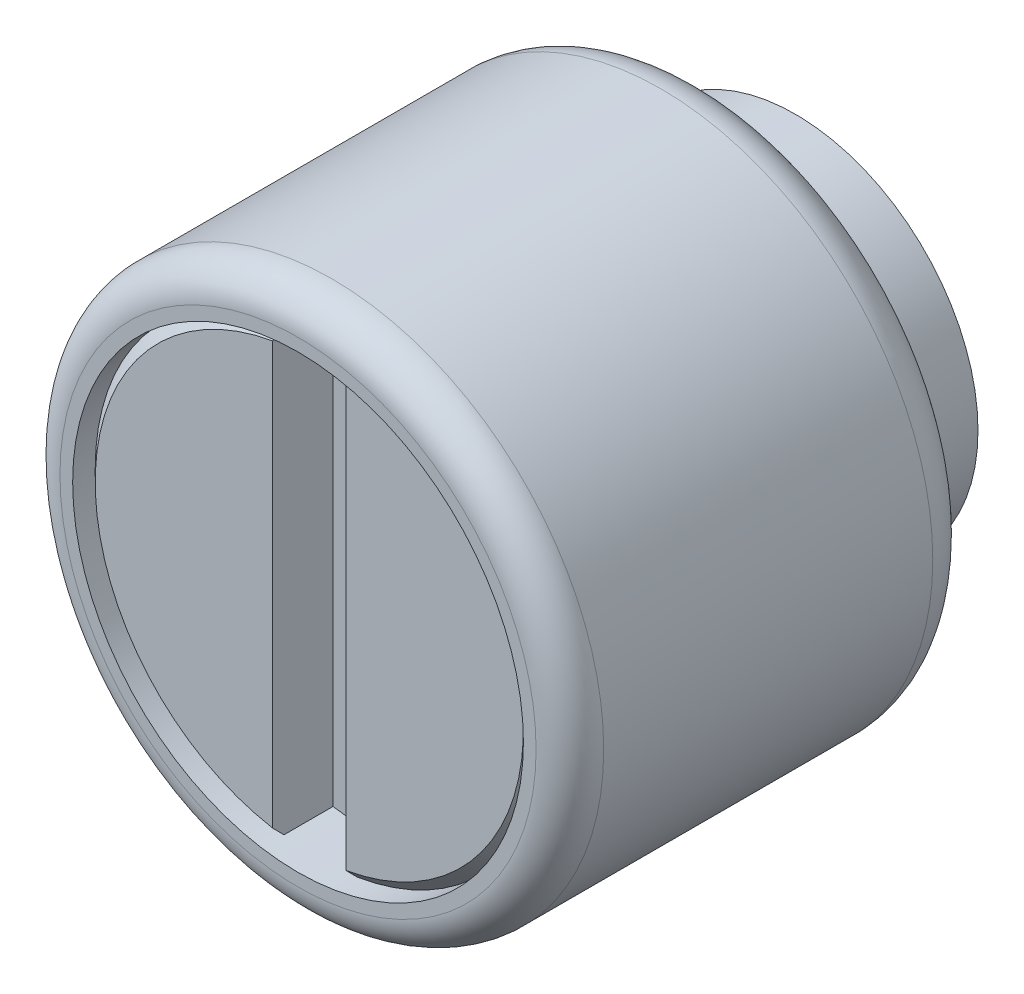
ISO-10303-21;
HEADER;
FILE_DESCRIPTION(('STEP AP214'),'2;1');
FILE_NAME('part.step','',(''),(''),'','','');
FILE_SCHEMA(('AUTOMOTIVE_DESIGN { 1 0 10303 214 1 1 1 1 }'));
ENDSEC;
DATA;
#1=APPLICATION_CONTEXT('core data for automotive mechanical design processes');
#2=APPLICATION_PROTOCOL_DEFINITION('international standard','automotive_design',2000,#1);
#3=PRODUCT_CONTEXT('',#1,'mechanical');
#4=PRODUCT('Part','Part','',(#3));
#5=PRODUCT_RELATED_PRODUCT_CATEGORY('part','',(#4));
#6=PRODUCT_DEFINITION_FORMATION('','',#4);
#7=PRODUCT_DEFINITION_CONTEXT('part definition',#1,'design');
#8=PRODUCT_DEFINITION('design','',#6,#7);
#9=PRODUCT_DEFINITION_SHAPE('','',#8);
#10=(LENGTH_UNIT() NAMED_UNIT(*) SI_UNIT(.MILLI.,.METRE.));
#11=(NAMED_UNIT(*) PLANE_ANGLE_UNIT() SI_UNIT($,.RADIAN.));
#12=(NAMED_UNIT(*) SI_UNIT($,.STERADIAN.) SOLID_ANGLE_UNIT());
#13=UNCERTAINTY_MEASURE_WITH_UNIT(LENGTH_MEASURE(1.E-05),#10,'distance_accuracy_value','');
#14=(GEOMETRIC_REPRESENTATION_CONTEXT(3) GLOBAL_UNCERTAINTY_ASSIGNED_CONTEXT((#13)) GLOBAL_UNIT_ASSIGNED_CONTEXT((#10,
#11,#12)) REPRESENTATION_CONTEXT('',''));
#15=CARTESIAN_POINT('',(0.,0.,0.));
#16=DIRECTION('',(0.,0.,1.));
#17=DIRECTION('',(1.,0.,0.));
#18=AXIS2_PLACEMENT_3D('',#15,#16,#17);
#19=CARTESIAN_POINT('',(0.,0.,5.97));
#20=DIRECTION('',(0.,0.,1.));
#21=DIRECTION('',(1.,0.,0.));
#22=AXIS2_PLACEMENT_3D('',#19,#20,#21);
#23=PLANE('',#22);
#24=DIRECTION('',(0.,1.,0.));
#25=VECTOR('',#24,1.);
#26=CARTESIAN_POINT('',(-0.650000000000001,-3.94683417437317,5.97));
#27=LINE('',#26,#25);
#28=CARTESIAN_POINT('',(-0.650000000000001,3.94683417437317,5.97));
#29=VERTEX_POINT('',#28);
#30=CARTESIAN_POINT('',(-0.650000000000001,-3.94683417437317,5.97));
#31=VERTEX_POINT('',#30);
#32=EDGE_CURVE('E299',#29,#31,#27,.F.);
#33=ORIENTED_EDGE('',*,*,#32,.T.);
#34=CARTESIAN_POINT('',(0.,0.,5.97));
#35=DIRECTION('',(0.,0.,1.));
#36=DIRECTION('',(1.,0.,0.));
#37=AXIS2_PLACEMENT_3D('',#34,#35,#36);
#38=CIRCLE('',#37,4.);
#39=CARTESIAN_POINT('',(0.649999999999999,-3.94683417437317,5.97));
#40=VERTEX_POINT('',#39);
#41=EDGE_CURVE('E92',#31,#40,#38,.T.);
#42=ORIENTED_EDGE('',*,*,#41,.T.);
#43=DIRECTION('',(0.,1.,0.));
#44=VECTOR('',#43,1.);
#45=CARTESIAN_POINT('',(0.649999999999999,3.94683417437317,5.97));
#46=LINE('',#45,#44);
#47=CARTESIAN_POINT('',(0.649999999999999,3.94683417437317,5.97));
#48=VERTEX_POINT('',#47);
#49=EDGE_CURVE('E95',#40,#48,#46,.T.);
#50=ORIENTED_EDGE('',*,*,#49,.T.);
#51=CARTESIAN_POINT('',(0.,0.,5.97));
#52=DIRECTION('',(0.,0.,1.));
#53=DIRECTION('',(1.,0.,0.));
#54=AXIS2_PLACEMENT_3D('',#51,#52,#53);
#55=CIRCLE('',#54,4.);
#56=EDGE_CURVE('E19',#48,#29,#55,.T.);
#57=ORIENTED_EDGE('',*,*,#56,.T.);
#58=EDGE_LOOP('',(#33,#42,#50,#57));
#59=FACE_BOUND('',#58,.T.);
#60=ADVANCED_FACE('F16',(#59),#23,.T.);
#61=CARTESIAN_POINT('',(0.649999999999998,3.94683417437317,7.23999999999999));
#62=DIRECTION('',(1.,0.,0.));
#63=DIRECTION('',(0.,0.,-1.));
#64=AXIS2_PLACEMENT_3D('',#61,#62,#63);
#65=PLANE('',#64);
#66=DIRECTION('',(0.,0.,-1.));
#67=VECTOR('',#66,1.);
#68=CARTESIAN_POINT('',(0.649999999999998,3.94683417437317,7.23999999999999));
#69=LINE('',#68,#67);
#70=CARTESIAN_POINT('',(0.649999999999998,3.94683417437317,6.83999999995824));
#71=VERTEX_POINT('',#70);
#72=EDGE_CURVE('E84',#48,#71,#69,.F.);
#73=ORIENTED_EDGE('',*,*,#72,.F.);
#74=ORIENTED_EDGE('',*,*,#49,.F.);
#75=DIRECTION('',(0.,0.,-1.));
#76=VECTOR('',#75,1.);
#77=CARTESIAN_POINT('',(0.649999999999998,-3.94683417437317,7.23999999999999));
#78=LINE('',#77,#76);
#79=CARTESIAN_POINT('',(0.649999999999998,-3.94683417435229,6.83999999997884));
#80=VERTEX_POINT('',#79);
#81=EDGE_CURVE('E98',#80,#40,#78,.T.);
#82=ORIENTED_EDGE('',*,*,#81,.F.);
#83=CARTESIAN_POINT('',(0.649999999999998,-3.74399519222822,7.03999999993489));
#84=CARTESIAN_POINT('',(0.649999999999998,-3.77781390657289,7.00667905729847));
#85=CARTESIAN_POINT('',(0.649999999999998,-3.81162651226838,6.97335191930114));
#86=CARTESIAN_POINT('',(0.649999999999998,-3.87923950630276,6.90668525264205));
#87=CARTESIAN_POINT('',(0.649999999999998,-3.91303989464167,6.87334572398031));
#88=CARTESIAN_POINT('',(0.649999999999998,-3.94683417433142,6.83999999995768));
#89=B_SPLINE_CURVE_WITH_KNOTS('',3,(#83,#84,#85,#86,#87,#88),.UNSPECIFIED.,.F.,.F.,(4,2,4),(0.,
0.142428627315955,0.28485725438661),.UNSPECIFIED.);
#90=CARTESIAN_POINT('',(0.649999999999998,-3.74399519221504,7.03999999994787));
#91=VERTEX_POINT('',#90);
#92=EDGE_CURVE('E111',#91,#80,#89,.T.);
#93=ORIENTED_EDGE('',*,*,#92,.F.);
#94=DIRECTION('',(0.,1.,0.));
#95=VECTOR('',#94,1.);
#96=CARTESIAN_POINT('',(0.649999999999998,0.,7.03999999999998));
#97=LINE('',#96,#95);
#98=CARTESIAN_POINT('',(0.649999999999998,3.74399519221504,7.03999999994787));
#99=VERTEX_POINT('',#98);
#100=EDGE_CURVE('E138',#99,#91,#97,.F.);
#101=ORIENTED_EDGE('',*,*,#100,.F.);
#102=CARTESIAN_POINT('',(0.649999999999998,3.94683417433285,6.83999999995627));
#103=CARTESIAN_POINT('',(0.649999999999998,3.91303989464286,6.87334572397914));
#104=CARTESIAN_POINT('',(0.649999999999998,3.87923950630372,6.90668525264111));
#105=CARTESIAN_POINT('',(0.649999999999998,3.81162651226886,6.97335191930067));
#106=CARTESIAN_POINT('',(0.649999999999998,3.77781390657313,7.00667905729824));
#107=CARTESIAN_POINT('',(0.649999999999998,3.74399519222822,7.03999999993489));
#108=B_SPLINE_CURVE_WITH_KNOTS('',3,(#102,#103,#104,#105,#106,#107),.UNSPECIFIED.,.F.,.F.,(4,2,
4),(0.,0.142428627071659,0.284857254388618),.UNSPECIFIED.);
#109=EDGE_CURVE('E103',#71,#99,#108,.T.);
#110=ORIENTED_EDGE('',*,*,#109,.F.);
#111=EDGE_LOOP('',(#73,#74,#82,#93,#101,#110));
#112=FACE_BOUND('',#111,.T.);
#113=ADVANCED_FACE('F101',(#112),#65,.F.);
#114=CARTESIAN_POINT('',(-0.650000000000001,-3.94683417437317,7.23999999999999));
#115=DIRECTION('',(-1.,0.,0.));
#116=DIRECTION('',(0.,0.,1.));
#117=AXIS2_PLACEMENT_3D('',#114,#115,#116);
#118=PLANE('',#117);
#119=DIRECTION('',(0.,1.,0.));
#120=VECTOR('',#119,1.);
#121=CARTESIAN_POINT('',(-0.650000000000001,0.,7.03999999999998));
#122=LINE('',#121,#120);
#123=CARTESIAN_POINT('',(-0.650000000000001,-3.74399519230684,7.03999999997112));
#124=VERTEX_POINT('',#123);
#125=CARTESIAN_POINT('',(-0.650000000000001,3.74399519230684,7.03999999997112));
#126=VERTEX_POINT('',#125);
#127=EDGE_CURVE('E129',#124,#126,#122,.T.);
#128=ORIENTED_EDGE('',*,*,#127,.F.);
#129=CARTESIAN_POINT('',(-0.650000000000001,-3.94683417435983,6.83999999998649));
#130=CARTESIAN_POINT('',(-0.650000000000001,-3.91303989467671,6.87334572401206));
#131=CARTESIAN_POINT('',(-0.650000000000001,-3.87923950634443,6.90668525267674));
#132=CARTESIAN_POINT('',(-0.650000000000001,-3.81162651232332,6.97335191934173));
#133=CARTESIAN_POINT('',(-0.650000000000001,-3.77781390663446,7.00667905734201));
#134=CARTESIAN_POINT('',(-0.650000000000001,-3.74399519229642,7.03999999998138));
#135=B_SPLINE_CURVE_WITH_KNOTS('',3,(#129,#130,#131,#132,#133,#134),.UNSPECIFIED.,.F.,.F.,(4,2,
4),(0.,0.142428627062691,0.284857254370685),.UNSPECIFIED.);
#136=CARTESIAN_POINT('',(-0.650000000000001,-3.94683417437317,6.83999999998666));
#137=VERTEX_POINT('',#136);
#138=EDGE_CURVE('E139',#137,#124,#135,.T.);
#139=ORIENTED_EDGE('',*,*,#138,.F.);
#140=DIRECTION('',(0.,0.,1.));
#141=VECTOR('',#140,1.);
#142=CARTESIAN_POINT('',(-0.650000000000001,-3.94683417437317,7.23999999999999));
#143=LINE('',#142,#141);
#144=EDGE_CURVE('E300',#31,#137,#143,.T.);
#145=ORIENTED_EDGE('',*,*,#144,.F.);
#146=ORIENTED_EDGE('',*,*,#32,.F.);
#147=DIRECTION('',(0.,0.,1.));
#148=VECTOR('',#147,1.);
#149=CARTESIAN_POINT('',(-0.650000000000001,3.94683417437317,7.23999999999999));
#150=LINE('',#149,#148);
#151=CARTESIAN_POINT('',(-0.650000000000001,3.9468341743665,6.83999999999324));
#152=VERTEX_POINT('',#151);
#153=EDGE_CURVE('E88',#152,#29,#150,.F.);
#154=ORIENTED_EDGE('',*,*,#153,.F.);
#155=CARTESIAN_POINT('',(-0.650000000000001,3.74399519229642,7.03999999998138));
#156=CARTESIAN_POINT('',(-0.650000000000001,3.77781390663447,7.00667905734201));
#157=CARTESIAN_POINT('',(-0.650000000000001,3.81162651232332,6.97335191934172));
#158=CARTESIAN_POINT('',(-0.650000000000001,3.87923950634444,6.90668525267674));
#159=CARTESIAN_POINT('',(-0.650000000000001,3.91303989467672,6.87334572401205));
#160=CARTESIAN_POINT('',(-0.650000000000001,3.94683417435983,6.83999999998648));
#161=B_SPLINE_CURVE_WITH_KNOTS('',3,(#155,#156,#157,#158,#159,#160),.UNSPECIFIED.,.F.,.F.,(4,2,
4),(0.,0.142428627307999,0.284857254370697),.UNSPECIFIED.);
#162=EDGE_CURVE('E130',#126,#152,#161,.T.);
#163=ORIENTED_EDGE('',*,*,#162,.F.);
#164=EDGE_LOOP('',(#128,#139,#145,#146,#154,#163));
#165=FACE_BOUND('',#164,.T.);
#166=ADVANCED_FACE('F144',(#165),#118,.F.);
#167=CARTESIAN_POINT('',(0.,0.,7.03999999999998));
#168=DIRECTION('',(0.,0.,1.));
#169=DIRECTION('',(1.,0.,0.));
#170=AXIS2_PLACEMENT_3D('',#167,#168,#169);
#171=PLANE('',#170);
#172=ORIENTED_EDGE('',*,*,#100,.T.);
#173=CARTESIAN_POINT('',(0.,0.,7.03999999996085));
#174=DIRECTION('',(0.,0.,-1.));
#175=DIRECTION('',(-1.,0.,0.));
#176=AXIS2_PLACEMENT_3D('',#173,#174,#175);
#177=CIRCLE('',#176,3.79999999989877);
#178=EDGE_CURVE('E126',#99,#91,#177,.T.);
#179=ORIENTED_EDGE('',*,*,#178,.F.);
#180=EDGE_LOOP('',(#172,#179));
#181=FACE_BOUND('',#180,.T.);
#182=ADVANCED_FACE('F180',(#181),#171,.T.);
#183=CARTESIAN_POINT('',(0.,0.,7.03999999999998));
#184=DIRECTION('',(0.,0.,1.));
#185=DIRECTION('',(1.,0.,0.));
#186=AXIS2_PLACEMENT_3D('',#183,#184,#185);
#187=PLANE('',#186);
#188=ORIENTED_EDGE('',*,*,#127,.T.);
#189=CARTESIAN_POINT('',(0.,0.,7.03999999996086));
#190=DIRECTION('',(0.,0.,-1.));
#191=DIRECTION('',(-1.,0.,0.));
#192=AXIS2_PLACEMENT_3D('',#189,#190,#191);
#193=CIRCLE('',#192,3.80000000001246);
#194=EDGE_CURVE('E123',#124,#126,#193,.T.);
#195=ORIENTED_EDGE('',*,*,#194,.F.);
#196=EDGE_LOOP('',(#188,#195));
#197=FACE_BOUND('',#196,.T.);
#198=ADVANCED_FACE('F160',(#197),#187,.T.);
#199=CARTESIAN_POINT('',(0.,0.,6.83999999995422));
#200=DIRECTION('',(0.,0.,-1.));
#201=DIRECTION('',(-1.,0.,0.));
#202=AXIS2_PLACEMENT_3D('',#199,#200,#201);
#203=CONICAL_SURFACE('',#202,3.99999999996226,0.785398163539556);
#204=ORIENTED_EDGE('',*,*,#92,.T.);
#205=CARTESIAN_POINT('',(0.,0.,6.84));
#206=DIRECTION('',(0.,0.,1.));
#207=DIRECTION('',(1.,0.,0.));
#208=AXIS2_PLACEMENT_3D('',#205,#206,#207);
#209=CIRCLE('',#208,4.);
#210=EDGE_CURVE('E107',#80,#71,#209,.T.);
#211=ORIENTED_EDGE('',*,*,#210,.T.);
#212=ORIENTED_EDGE('',*,*,#109,.T.);
#213=ORIENTED_EDGE('',*,*,#178,.T.);
#214=EDGE_LOOP('',(#204,#211,#212,#213));
#215=FACE_BOUND('',#214,.T.);
#216=ADVANCED_FACE('F153',(#215),#203,.T.);
#217=CARTESIAN_POINT('',(0.,0.,6.83999999995422));
#218=DIRECTION('',(0.,0.,-1.));
#219=DIRECTION('',(-1.,0.,0.));
#220=AXIS2_PLACEMENT_3D('',#217,#218,#219);
#221=CONICAL_SURFACE('',#220,4.0000000000191,0.785398163397447);
#222=ORIENTED_EDGE('',*,*,#138,.T.);
#223=ORIENTED_EDGE('',*,*,#194,.T.);
#224=ORIENTED_EDGE('',*,*,#162,.T.);
#225=CARTESIAN_POINT('',(0.,0.,6.84));
#226=DIRECTION('',(0.,0.,1.));
#227=DIRECTION('',(1.,0.,0.));
#228=AXIS2_PLACEMENT_3D('',#225,#226,#227);
#229=CIRCLE('',#228,4.);
#230=EDGE_CURVE('E122',#152,#137,#229,.T.);
#231=ORIENTED_EDGE('',*,*,#230,.T.);
#232=EDGE_LOOP('',(#222,#223,#224,#231));
#233=FACE_BOUND('',#232,.T.);
#234=ADVANCED_FACE('F147',(#233),#221,.T.);
#235=CARTESIAN_POINT('',(3.23999999999999,0.,-1.5875));
#236=DIRECTION('',(0.,0.,-1.));
#237=DIRECTION('',(-1.,0.,0.));
#238=AXIS2_PLACEMENT_3D('',#235,#236,#237);
#239=PLANE('',#238);
#240=CARTESIAN_POINT('',(0.,0.,-1.5875));
#241=DIRECTION('',(0.,0.,1.));
#242=DIRECTION('',(1.,0.,0.));
#243=AXIS2_PLACEMENT_3D('',#240,#241,#242);
#244=CIRCLE('',#243,3.23999999999999);
#245=CARTESIAN_POINT('',(3.23999999999999,0.,-1.5875));
#246=VERTEX_POINT('',#245);
#247=EDGE_CURVE('E119',#246,#246,#244,.T.);
#248=ORIENTED_EDGE('',*,*,#247,.F.);
#249=EDGE_LOOP('',(#248));
#250=FACE_BOUND('',#249,.T.);
#251=ADVANCED_FACE('F152',(#250),#239,.T.);
#252=CARTESIAN_POINT('',(0.,0.,7.04000000000001));
#253=DIRECTION('',(0.,0.,1.));
#254=DIRECTION('',(1.,0.,0.));
#255=AXIS2_PLACEMENT_3D('',#252,#253,#254);
#256=CYLINDRICAL_SURFACE('',#255,4.);
#257=ORIENTED_EDGE('',*,*,#144,.T.);
#258=ORIENTED_EDGE('',*,*,#230,.F.);
#259=ORIENTED_EDGE('',*,*,#153,.T.);
#260=ORIENTED_EDGE('',*,*,#56,.F.);
#261=ORIENTED_EDGE('',*,*,#72,.T.);
#262=ORIENTED_EDGE('',*,*,#210,.F.);
#263=ORIENTED_EDGE('',*,*,#81,.T.);
#264=ORIENTED_EDGE('',*,*,#41,.F.);
#265=EDGE_LOOP('',(#257,#258,#259,#260,#261,#262,#263,#264));
#266=FACE_BOUND('',#265,.T.);
#267=CARTESIAN_POINT('',(0.,0.,7.23999999999999));
#268=DIRECTION('',(0.,0.,1.));
#269=DIRECTION('',(1.,0.,0.));
#270=AXIS2_PLACEMENT_3D('',#267,#268,#269);
#271=CIRCLE('',#270,4.);
#272=CARTESIAN_POINT('',(4.,0.,7.24));
#273=VERTEX_POINT('',#272);
#274=EDGE_CURVE('E116',#273,#273,#271,.F.);
#275=ORIENTED_EDGE('',*,*,#274,.F.);
#276=EDGE_LOOP('',(#275));
#277=FACE_BOUND('',#276,.T.);
#278=ADVANCED_FACE('F80',(#266,#277),#256,.F.);
#279=CARTESIAN_POINT('',(0.,0.,-0.79375));
#280=DIRECTION('',(0.,0.,1.));
#281=DIRECTION('',(1.,0.,0.));
#282=AXIS2_PLACEMENT_3D('',#279,#280,#281);
#283=CYLINDRICAL_SURFACE('',#282,3.23999999999999);
#284=ORIENTED_EDGE('',*,*,#247,.T.);
#285=EDGE_LOOP('',(#284));
#286=FACE_BOUND('',#285,.T.);
#287=CARTESIAN_POINT('',(0.,0.,0.));
#288=DIRECTION('',(0.,0.,1.));
#289=DIRECTION('',(1.,0.,0.));
#290=AXIS2_PLACEMENT_3D('',#287,#288,#289);
#291=CIRCLE('',#290,3.23999999999999);
#292=CARTESIAN_POINT('',(3.23999999999999,0.,0.));
#293=VERTEX_POINT('',#292);
#294=EDGE_CURVE('E112',#293,#293,#291,.T.);
#295=ORIENTED_EDGE('',*,*,#294,.F.);
#296=EDGE_LOOP('',(#295));
#297=FACE_BOUND('',#296,.T.);
#298=ADVANCED_FACE('F336',(#286,#297),#283,.T.);
#299=CARTESIAN_POINT('',(4.,0.,7.23999999999999));
#300=DIRECTION('',(0.,0.,1.));
#301=DIRECTION('',(1.,0.,0.));
#302=AXIS2_PLACEMENT_3D('',#299,#300,#301);
#303=PLANE('',#302);
#304=ORIENTED_EDGE('',*,*,#274,.T.);
#305=EDGE_LOOP('',(#304));
#306=FACE_BOUND('',#305,.T.);
#307=CARTESIAN_POINT('',(0.,0.,7.24000000000001));
#308=DIRECTION('',(0.,0.,-1.));
#309=DIRECTION('',(1.,0.,0.));
#310=AXIS2_PLACEMENT_3D('',#307,#308,#309);
#311=CIRCLE('',#310,4.22499999999999);
#312=CARTESIAN_POINT('',(4.225,0.,7.24));
#313=VERTEX_POINT('',#312);
#314=CARTESIAN_POINT('',(-4.22500000000001,0.,7.24));
#315=VERTEX_POINT('',#314);
#316=EDGE_CURVE('E255',#313,#315,#311,.T.);
#317=ORIENTED_EDGE('',*,*,#316,.F.);
#318=CARTESIAN_POINT('',(0.,0.,7.24000000000001));
#319=DIRECTION('',(0.,0.,-1.));
#320=DIRECTION('',(-1.,0.,0.));
#321=AXIS2_PLACEMENT_3D('',#318,#319,#320);
#322=CIRCLE('',#321,4.22500000000001);
#323=EDGE_CURVE('E115',#315,#313,#322,.T.);
#324=ORIENTED_EDGE('',*,*,#323,.F.);
#325=EDGE_LOOP('',(#317,#324));
#326=FACE_BOUND('',#325,.T.);
#327=ADVANCED_FACE('F221',(#306,#326),#303,.T.);
#328=CARTESIAN_POINT('',(4.825,0.,0.));
#329=DIRECTION('',(0.,0.,-1.));
#330=DIRECTION('',(-1.,0.,0.));
#331=AXIS2_PLACEMENT_3D('',#328,#329,#330);
#332=PLANE('',#331);
#333=ORIENTED_EDGE('',*,*,#294,.T.);
#334=EDGE_LOOP('',(#333));
#335=FACE_BOUND('',#334,.T.);
#336=CARTESIAN_POINT('',(0.,0.,0.));
#337=DIRECTION('',(0.,0.,1.));
#338=DIRECTION('',(1.,0.,0.));
#339=AXIS2_PLACEMENT_3D('',#336,#337,#338);
#340=CIRCLE('',#339,4.025);
#341=CARTESIAN_POINT('',(4.025,0.,0.));
#342=VERTEX_POINT('',#341);
#343=CARTESIAN_POINT('',(-4.025,0.,0.));
#344=VERTEX_POINT('',#343);
#345=EDGE_CURVE('E33',#342,#344,#340,.T.);
#346=ORIENTED_EDGE('',*,*,#345,.F.);
#347=CARTESIAN_POINT('',(0.,0.,0.));
#348=DIRECTION('',(0.,0.,1.));
#349=DIRECTION('',(-1.,0.,0.));
#350=AXIS2_PLACEMENT_3D('',#347,#348,#349);
#351=CIRCLE('',#350,4.025);
#352=EDGE_CURVE('E243',#344,#342,#351,.T.);
#353=ORIENTED_EDGE('',*,*,#352,.F.);
#354=EDGE_LOOP('',(#346,#353));
#355=FACE_BOUND('',#354,.T.);
#356=ADVANCED_FACE('F212',(#335,#355),#332,.T.);
#357=CARTESIAN_POINT('',(0.,0.,6.64000000000001));
#358=DIRECTION('',(0.,0.,1.));
#359=DIRECTION('',(1.,0.,0.));
#360=AXIS2_PLACEMENT_3D('',#357,#358,#359);
#361=TOROIDAL_SURFACE('',#360,4.22500000000002,0.6);
#362=CARTESIAN_POINT('',(0.,0.,6.64000000000001));
#363=DIRECTION('',(0.,0.,1.));
#364=DIRECTION('',(1.,0.,0.));
#365=AXIS2_PLACEMENT_3D('',#362,#363,#364);
#366=CIRCLE('',#365,4.825);
#367=CARTESIAN_POINT('',(4.825,0.,6.64000000000001));
#368=VERTEX_POINT('',#367);
#369=EDGE_CURVE('E25',#368,#368,#366,.F.);
#370=ORIENTED_EDGE('',*,*,#369,.F.);
#371=EDGE_LOOP('',(#370));
#372=FACE_BOUND('',#371,.T.);
#373=ORIENTED_EDGE('',*,*,#316,.T.);
#374=ORIENTED_EDGE('',*,*,#323,.T.);
#375=EDGE_LOOP('',(#373,#374));
#376=FACE_BOUND('',#375,.T.);
#377=ADVANCED_FACE('F190',(#372,#376),#361,.T.);
#378=CARTESIAN_POINT('',(0.,0.,0.799999999999998));
#379=DIRECTION('',(0.,0.,1.));
#380=DIRECTION('',(1.,0.,0.));
#381=AXIS2_PLACEMENT_3D('',#378,#379,#380);
#382=TOROIDAL_SURFACE('',#381,4.025,0.8);
#383=ORIENTED_EDGE('',*,*,#345,.T.);
#384=ORIENTED_EDGE('',*,*,#352,.T.);
#385=EDGE_LOOP('',(#383,#384));
#386=FACE_BOUND('',#385,.T.);
#387=CARTESIAN_POINT('',(0.,0.,0.799999999999999));
#388=DIRECTION('',(0.,0.,1.));
#389=DIRECTION('',(1.,0.,0.));
#390=AXIS2_PLACEMENT_3D('',#387,#388,#389);
#391=CIRCLE('',#390,4.825);
#392=CARTESIAN_POINT('',(4.825,0.,0.8));
#393=VERTEX_POINT('',#392);
#394=EDGE_CURVE('E11',#393,#393,#391,.T.);
#395=ORIENTED_EDGE('',*,*,#394,.F.);
#396=EDGE_LOOP('',(#395));
#397=FACE_BOUND('',#396,.T.);
#398=ADVANCED_FACE('F184',(#386,#397),#382,.T.);
#399=CARTESIAN_POINT('',(0.,0.,3.62));
#400=DIRECTION('',(0.,0.,1.));
#401=DIRECTION('',(1.,0.,0.));
#402=AXIS2_PLACEMENT_3D('',#399,#400,#401);
#403=CYLINDRICAL_SURFACE('',#402,4.825);
#404=ORIENTED_EDGE('',*,*,#394,.T.);
#405=EDGE_LOOP('',(#404));
#406=FACE_BOUND('',#405,.T.);
#407=ORIENTED_EDGE('',*,*,#369,.T.);
#408=EDGE_LOOP('',(#407));
#409=FACE_BOUND('',#408,.T.);
#410=ADVANCED_FACE('F182',(#406,#409),#403,.T.);
#411=CLOSED_SHELL('',(#60,#113,#166,#182,#198,#216,#234,#251,#278,#298,#327,#356,#377,#398,#410));
#412=MANIFOLD_SOLID_BREP('B1',#411);
#413=ADVANCED_BREP_SHAPE_REPRESENTATION('',(#18,#412),#14);
#414=SHAPE_DEFINITION_REPRESENTATION(#9,#413);
ENDSEC;
END-ISO-10303-21;
